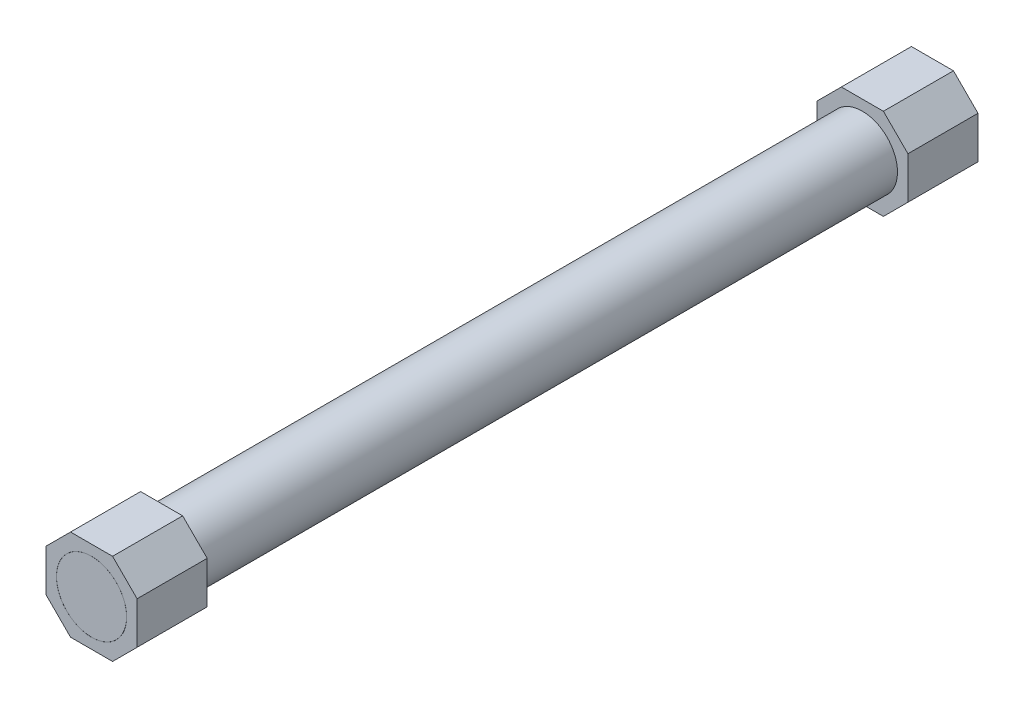
ISO-10303-21;
HEADER;
FILE_DESCRIPTION(('STEP AP214'),'2;1');
FILE_NAME('part.step','',(''),(''),'','','');
FILE_SCHEMA(('AUTOMOTIVE_DESIGN { 1 0 10303 214 1 1 1 1 }'));
ENDSEC;
DATA;
#1=APPLICATION_CONTEXT('core data for automotive mechanical design processes');
#2=APPLICATION_PROTOCOL_DEFINITION('international standard','automotive_design',2000,#1);
#3=PRODUCT_CONTEXT('',#1,'mechanical');
#4=PRODUCT('Part','Part','',(#3));
#5=PRODUCT_RELATED_PRODUCT_CATEGORY('part','',(#4));
#6=PRODUCT_DEFINITION_FORMATION('','',#4);
#7=PRODUCT_DEFINITION_CONTEXT('part definition',#1,'design');
#8=PRODUCT_DEFINITION('design','',#6,#7);
#9=PRODUCT_DEFINITION_SHAPE('','',#8);
#10=(LENGTH_UNIT() NAMED_UNIT(*) SI_UNIT(.MILLI.,.METRE.));
#11=(NAMED_UNIT(*) PLANE_ANGLE_UNIT() SI_UNIT($,.RADIAN.));
#12=(NAMED_UNIT(*) SI_UNIT($,.STERADIAN.) SOLID_ANGLE_UNIT());
#13=UNCERTAINTY_MEASURE_WITH_UNIT(LENGTH_MEASURE(1.E-05),#10,'distance_accuracy_value','');
#14=(GEOMETRIC_REPRESENTATION_CONTEXT(3) GLOBAL_UNCERTAINTY_ASSIGNED_CONTEXT((#13)) GLOBAL_UNIT_ASSIGNED_CONTEXT((#10,
#11,#12)) REPRESENTATION_CONTEXT('',''));
#15=CARTESIAN_POINT('',(0.,0.,0.));
#16=DIRECTION('',(0.,0.,1.));
#17=DIRECTION('',(1.,0.,0.));
#18=AXIS2_PLACEMENT_3D('',#15,#16,#17);
#19=CARTESIAN_POINT('',(-3.,6.5,9.99999999999999));
#20=DIRECTION('',(-0.707106781186548,0.707106781186547,0.));
#21=DIRECTION('',(-0.707106781186547,-0.707106781186548,0.));
#22=AXIS2_PLACEMENT_3D('',#19,#20,#21);
#23=PLANE('',#22);
#24=DIRECTION('',(-0.707106781186547,-0.707106781186548,0.));
#25=VECTOR('',#24,1.);
#26=CARTESIAN_POINT('',(-3.,6.5,0.));
#27=LINE('',#26,#25);
#28=CARTESIAN_POINT('',(-3.,6.5,0.));
#29=VERTEX_POINT('',#28);
#30=CARTESIAN_POINT('',(-6.5,3.,0.));
#31=VERTEX_POINT('',#30);
#32=EDGE_CURVE('E148',#29,#31,#27,.T.);
#33=ORIENTED_EDGE('',*,*,#32,.T.);
#34=DIRECTION('',(0.,0.,-1.));
#35=VECTOR('',#34,1.);
#36=CARTESIAN_POINT('',(-6.5,3.,9.99999999999999));
#37=LINE('',#36,#35);
#38=CARTESIAN_POINT('',(-6.5,3.,9.99999999999999));
#39=VERTEX_POINT('',#38);
#40=EDGE_CURVE('E55',#39,#31,#37,.T.);
#41=ORIENTED_EDGE('',*,*,#40,.F.);
#42=DIRECTION('',(-0.707106781186547,-0.707106781186548,0.));
#43=VECTOR('',#42,1.);
#44=CARTESIAN_POINT('',(-3.,6.5,9.99999999999999));
#45=LINE('',#44,#43);
#46=CARTESIAN_POINT('',(-3.,6.5,9.99999999999999));
#47=VERTEX_POINT('',#46);
#48=EDGE_CURVE('E162',#47,#39,#45,.T.);
#49=ORIENTED_EDGE('',*,*,#48,.F.);
#50=DIRECTION('',(0.,0.,-1.));
#51=VECTOR('',#50,1.);
#52=CARTESIAN_POINT('',(-3.,6.5,9.99999999999999));
#53=LINE('',#52,#51);
#54=EDGE_CURVE('E12',#47,#29,#53,.T.);
#55=ORIENTED_EDGE('',*,*,#54,.T.);
#56=EDGE_LOOP('',(#33,#41,#49,#55));
#57=FACE_BOUND('',#56,.T.);
#58=ADVANCED_FACE('F52',(#57),#23,.T.);
#59=CARTESIAN_POINT('',(3.,6.5,9.99999999999999));
#60=DIRECTION('',(0.,1.,0.));
#61=DIRECTION('',(-1.,0.,0.));
#62=AXIS2_PLACEMENT_3D('',#59,#60,#61);
#63=PLANE('',#62);
#64=DIRECTION('',(-1.,0.,0.));
#65=VECTOR('',#64,1.);
#66=CARTESIAN_POINT('',(3.,6.5,0.));
#67=LINE('',#66,#65);
#68=CARTESIAN_POINT('',(3.,6.5,0.));
#69=VERTEX_POINT('',#68);
#70=EDGE_CURVE('E105',#69,#29,#67,.T.);
#71=ORIENTED_EDGE('',*,*,#70,.T.);
#72=ORIENTED_EDGE('',*,*,#54,.F.);
#73=DIRECTION('',(-1.,0.,0.));
#74=VECTOR('',#73,1.);
#75=CARTESIAN_POINT('',(3.,6.5,9.99999999999999));
#76=LINE('',#75,#74);
#77=CARTESIAN_POINT('',(3.,6.5,9.99999999999999));
#78=VERTEX_POINT('',#77);
#79=EDGE_CURVE('E70',#78,#47,#76,.T.);
#80=ORIENTED_EDGE('',*,*,#79,.F.);
#81=DIRECTION('',(0.,0.,-1.));
#82=VECTOR('',#81,1.);
#83=CARTESIAN_POINT('',(3.,6.5,9.99999999999999));
#84=LINE('',#83,#82);
#85=EDGE_CURVE('E61',#78,#69,#84,.T.);
#86=ORIENTED_EDGE('',*,*,#85,.T.);
#87=EDGE_LOOP('',(#71,#72,#80,#86));
#88=FACE_BOUND('',#87,.T.);
#89=ADVANCED_FACE('F217',(#88),#63,.T.);
#90=CARTESIAN_POINT('',(3.,6.5,9.99999999999999));
#91=DIRECTION('',(0.707106781186547,0.707106781186548,0.));
#92=DIRECTION('',(-0.707106781186548,0.707106781186547,0.));
#93=AXIS2_PLACEMENT_3D('',#90,#91,#92);
#94=PLANE('',#93);
#95=DIRECTION('',(-0.707106781186548,0.707106781186547,0.));
#96=VECTOR('',#95,1.);
#97=CARTESIAN_POINT('',(3.,6.5,0.));
#98=LINE('',#97,#96);
#99=CARTESIAN_POINT('',(6.5,3.,0.));
#100=VERTEX_POINT('',#99);
#101=EDGE_CURVE('E99',#100,#69,#98,.T.);
#102=ORIENTED_EDGE('',*,*,#101,.T.);
#103=ORIENTED_EDGE('',*,*,#85,.F.);
#104=DIRECTION('',(-0.707106781186548,0.707106781186547,0.));
#105=VECTOR('',#104,1.);
#106=CARTESIAN_POINT('',(3.,6.5,9.99999999999999));
#107=LINE('',#106,#105);
#108=CARTESIAN_POINT('',(6.5,3.,9.99999999999999));
#109=VERTEX_POINT('',#108);
#110=EDGE_CURVE('E130',#109,#78,#107,.T.);
#111=ORIENTED_EDGE('',*,*,#110,.F.);
#112=DIRECTION('',(0.,0.,-1.));
#113=VECTOR('',#112,1.);
#114=CARTESIAN_POINT('',(6.5,3.,9.99999999999999));
#115=LINE('',#114,#113);
#116=EDGE_CURVE('E137',#109,#100,#115,.T.);
#117=ORIENTED_EDGE('',*,*,#116,.T.);
#118=EDGE_LOOP('',(#102,#103,#111,#117));
#119=FACE_BOUND('',#118,.T.);
#120=ADVANCED_FACE('F143',(#119),#94,.T.);
#121=CARTESIAN_POINT('',(6.5,3.,9.99999999999999));
#122=DIRECTION('',(1.,0.,0.));
#123=DIRECTION('',(0.,1.,0.));
#124=AXIS2_PLACEMENT_3D('',#121,#122,#123);
#125=PLANE('',#124);
#126=DIRECTION('',(0.,1.,0.));
#127=VECTOR('',#126,1.);
#128=CARTESIAN_POINT('',(6.5,3.,0.));
#129=LINE('',#128,#127);
#130=CARTESIAN_POINT('',(6.5,-2.99999999999999,0.));
#131=VERTEX_POINT('',#130);
#132=EDGE_CURVE('E140',#131,#100,#129,.T.);
#133=ORIENTED_EDGE('',*,*,#132,.T.);
#134=ORIENTED_EDGE('',*,*,#116,.F.);
#135=DIRECTION('',(0.,1.,0.));
#136=VECTOR('',#135,1.);
#137=CARTESIAN_POINT('',(6.5,3.,9.99999999999999));
#138=LINE('',#137,#136);
#139=CARTESIAN_POINT('',(6.5,-2.99999999999999,9.99999999999999));
#140=VERTEX_POINT('',#139);
#141=EDGE_CURVE('E126',#140,#109,#138,.T.);
#142=ORIENTED_EDGE('',*,*,#141,.F.);
#143=DIRECTION('',(0.,0.,-1.));
#144=VECTOR('',#143,1.);
#145=CARTESIAN_POINT('',(6.5,-2.99999999999999,9.99999999999999));
#146=LINE('',#145,#144);
#147=EDGE_CURVE('E141',#140,#131,#146,.T.);
#148=ORIENTED_EDGE('',*,*,#147,.T.);
#149=EDGE_LOOP('',(#133,#134,#142,#148));
#150=FACE_BOUND('',#149,.T.);
#151=ADVANCED_FACE('F138',(#150),#125,.T.);
#152=CARTESIAN_POINT('',(6.5,-2.99999999999999,9.99999999999999));
#153=DIRECTION('',(0.707106781186548,-0.707106781186547,0.));
#154=DIRECTION('',(0.707106781186547,0.707106781186548,0.));
#155=AXIS2_PLACEMENT_3D('',#152,#153,#154);
#156=PLANE('',#155);
#157=DIRECTION('',(0.707106781186547,0.707106781186548,0.));
#158=VECTOR('',#157,1.);
#159=CARTESIAN_POINT('',(6.5,-2.99999999999999,0.));
#160=LINE('',#159,#158);
#161=CARTESIAN_POINT('',(3.,-6.49999999999999,0.));
#162=VERTEX_POINT('',#161);
#163=EDGE_CURVE('E158',#162,#131,#160,.T.);
#164=ORIENTED_EDGE('',*,*,#163,.T.);
#165=ORIENTED_EDGE('',*,*,#147,.F.);
#166=DIRECTION('',(0.707106781186547,0.707106781186548,0.));
#167=VECTOR('',#166,1.);
#168=CARTESIAN_POINT('',(6.5,-2.99999999999999,9.99999999999999));
#169=LINE('',#168,#167);
#170=CARTESIAN_POINT('',(3.,-6.49999999999999,9.99999999999999));
#171=VERTEX_POINT('',#170);
#172=EDGE_CURVE('E132',#171,#140,#169,.T.);
#173=ORIENTED_EDGE('',*,*,#172,.F.);
#174=DIRECTION('',(0.,0.,-1.));
#175=VECTOR('',#174,1.);
#176=CARTESIAN_POINT('',(3.,-6.49999999999999,9.99999999999999));
#177=LINE('',#176,#175);
#178=EDGE_CURVE('E166',#171,#162,#177,.T.);
#179=ORIENTED_EDGE('',*,*,#178,.T.);
#180=EDGE_LOOP('',(#164,#165,#173,#179));
#181=FACE_BOUND('',#180,.T.);
#182=ADVANCED_FACE('F229',(#181),#156,.T.);
#183=CARTESIAN_POINT('',(-3.,-6.5,9.99999999999999));
#184=DIRECTION('',(0.,-1.,0.));
#185=DIRECTION('',(1.,0.,0.));
#186=AXIS2_PLACEMENT_3D('',#183,#184,#185);
#187=PLANE('',#186);
#188=DIRECTION('',(1.,0.,0.));
#189=VECTOR('',#188,1.);
#190=CARTESIAN_POINT('',(-3.,-6.5,0.));
#191=LINE('',#190,#189);
#192=CARTESIAN_POINT('',(-3.,-6.5,0.));
#193=VERTEX_POINT('',#192);
#194=EDGE_CURVE('E156',#193,#162,#191,.T.);
#195=ORIENTED_EDGE('',*,*,#194,.T.);
#196=ORIENTED_EDGE('',*,*,#178,.F.);
#197=DIRECTION('',(1.,0.,0.));
#198=VECTOR('',#197,1.);
#199=CARTESIAN_POINT('',(-3.,-6.5,9.99999999999999));
#200=LINE('',#199,#198);
#201=CARTESIAN_POINT('',(-3.,-6.5,9.99999999999999));
#202=VERTEX_POINT('',#201);
#203=EDGE_CURVE('E191',#202,#171,#200,.T.);
#204=ORIENTED_EDGE('',*,*,#203,.F.);
#205=DIRECTION('',(0.,0.,-1.));
#206=VECTOR('',#205,1.);
#207=CARTESIAN_POINT('',(-3.,-6.5,9.99999999999999));
#208=LINE('',#207,#206);
#209=EDGE_CURVE('E169',#202,#193,#208,.T.);
#210=ORIENTED_EDGE('',*,*,#209,.T.);
#211=EDGE_LOOP('',(#195,#196,#204,#210));
#212=FACE_BOUND('',#211,.T.);
#213=ADVANCED_FACE('F189',(#212),#187,.T.);
#214=CARTESIAN_POINT('',(-6.5,-3.,9.99999999999999));
#215=DIRECTION('',(-0.707106781186547,-0.707106781186548,0.));
#216=DIRECTION('',(0.707106781186548,-0.707106781186547,0.));
#217=AXIS2_PLACEMENT_3D('',#214,#215,#216);
#218=PLANE('',#217);
#219=DIRECTION('',(0.707106781186548,-0.707106781186547,0.));
#220=VECTOR('',#219,1.);
#221=CARTESIAN_POINT('',(-6.5,-3.,0.));
#222=LINE('',#221,#220);
#223=CARTESIAN_POINT('',(-6.5,-3.,0.));
#224=VERTEX_POINT('',#223);
#225=EDGE_CURVE('E154',#224,#193,#222,.T.);
#226=ORIENTED_EDGE('',*,*,#225,.T.);
#227=ORIENTED_EDGE('',*,*,#209,.F.);
#228=DIRECTION('',(0.707106781186548,-0.707106781186547,0.));
#229=VECTOR('',#228,1.);
#230=CARTESIAN_POINT('',(-6.5,-3.,9.99999999999999));
#231=LINE('',#230,#229);
#232=CARTESIAN_POINT('',(-6.5,-3.,9.99999999999999));
#233=VERTEX_POINT('',#232);
#234=EDGE_CURVE('E192',#233,#202,#231,.T.);
#235=ORIENTED_EDGE('',*,*,#234,.F.);
#236=DIRECTION('',(0.,0.,-1.));
#237=VECTOR('',#236,1.);
#238=CARTESIAN_POINT('',(-6.5,-3.,9.99999999999999));
#239=LINE('',#238,#237);
#240=EDGE_CURVE('E171',#233,#224,#239,.T.);
#241=ORIENTED_EDGE('',*,*,#240,.T.);
#242=EDGE_LOOP('',(#226,#227,#235,#241));
#243=FACE_BOUND('',#242,.T.);
#244=ADVANCED_FACE('F186',(#243),#218,.T.);
#245=CARTESIAN_POINT('',(-6.5,3.,9.99999999999999));
#246=DIRECTION('',(-1.,0.,0.));
#247=DIRECTION('',(0.,0.,-1.));
#248=AXIS2_PLACEMENT_3D('',#245,#246,#247);
#249=PLANE('',#248);
#250=DIRECTION('',(0.,-1.,0.));
#251=VECTOR('',#250,1.);
#252=CARTESIAN_POINT('',(-6.5,3.,0.));
#253=LINE('',#252,#251);
#254=EDGE_CURVE('E151',#31,#224,#253,.T.);
#255=ORIENTED_EDGE('',*,*,#254,.T.);
#256=ORIENTED_EDGE('',*,*,#240,.F.);
#257=DIRECTION('',(0.,-1.,0.));
#258=VECTOR('',#257,1.);
#259=CARTESIAN_POINT('',(-6.5,3.,9.99999999999999));
#260=LINE('',#259,#258);
#261=EDGE_CURVE('E113',#39,#233,#260,.T.);
#262=ORIENTED_EDGE('',*,*,#261,.F.);
#263=ORIENTED_EDGE('',*,*,#40,.T.);
#264=EDGE_LOOP('',(#255,#256,#262,#263));
#265=FACE_BOUND('',#264,.T.);
#266=ADVANCED_FACE('F177',(#265),#249,.T.);
#267=CARTESIAN_POINT('',(0.,0.,9.99999999999999));
#268=DIRECTION('',(0.,0.,-1.));
#269=DIRECTION('',(1.,0.,0.));
#270=AXIS2_PLACEMENT_3D('',#267,#268,#269);
#271=PLANE('',#270);
#272=CARTESIAN_POINT('',(0.,0.,9.99999999999999));
#273=DIRECTION('',(0.,0.,1.));
#274=DIRECTION('',(1.,0.,0.));
#275=AXIS2_PLACEMENT_3D('',#272,#273,#274);
#276=CIRCLE('',#275,5.01);
#277=CARTESIAN_POINT('',(5.01,0.,9.99999999999999));
#278=VERTEX_POINT('',#277);
#279=EDGE_CURVE('E152',#278,#278,#276,.T.);
#280=ORIENTED_EDGE('',*,*,#279,.F.);
#281=EDGE_LOOP('',(#280));
#282=FACE_BOUND('',#281,.T.);
#283=ORIENTED_EDGE('',*,*,#48,.T.);
#284=ORIENTED_EDGE('',*,*,#261,.T.);
#285=ORIENTED_EDGE('',*,*,#234,.T.);
#286=ORIENTED_EDGE('',*,*,#203,.T.);
#287=ORIENTED_EDGE('',*,*,#172,.T.);
#288=ORIENTED_EDGE('',*,*,#141,.T.);
#289=ORIENTED_EDGE('',*,*,#110,.T.);
#290=ORIENTED_EDGE('',*,*,#79,.T.);
#291=EDGE_LOOP('',(#283,#284,#285,#286,#287,#288,#289,#290));
#292=FACE_BOUND('',#291,.T.);
#293=ADVANCED_FACE('F128',(#282,#292),#271,.F.);
#294=CARTESIAN_POINT('',(0.,0.,0.));
#295=DIRECTION('',(0.,0.,-1.));
#296=DIRECTION('',(1.,0.,0.));
#297=AXIS2_PLACEMENT_3D('',#294,#295,#296);
#298=PLANE('',#297);
#299=CARTESIAN_POINT('',(0.,0.,0.));
#300=DIRECTION('',(0.,0.,1.));
#301=DIRECTION('',(1.,0.,0.));
#302=AXIS2_PLACEMENT_3D('',#299,#300,#301);
#303=CIRCLE('',#302,5.01);
#304=CARTESIAN_POINT('',(5.01,0.,0.));
#305=VERTEX_POINT('',#304);
#306=EDGE_CURVE('E198',#305,#305,#303,.T.);
#307=ORIENTED_EDGE('',*,*,#306,.T.);
#308=EDGE_LOOP('',(#307));
#309=FACE_BOUND('',#308,.T.);
#310=ORIENTED_EDGE('',*,*,#32,.F.);
#311=ORIENTED_EDGE('',*,*,#70,.F.);
#312=ORIENTED_EDGE('',*,*,#101,.F.);
#313=ORIENTED_EDGE('',*,*,#132,.F.);
#314=ORIENTED_EDGE('',*,*,#163,.F.);
#315=ORIENTED_EDGE('',*,*,#194,.F.);
#316=ORIENTED_EDGE('',*,*,#225,.F.);
#317=ORIENTED_EDGE('',*,*,#254,.F.);
#318=EDGE_LOOP('',(#310,#311,#312,#313,#314,#315,#316,#317));
#319=FACE_BOUND('',#318,.T.);
#320=ADVANCED_FACE('F182',(#309,#319),#298,.T.);
#321=CARTESIAN_POINT('',(0.,0.,9.99999999999999));
#322=DIRECTION('',(0.,0.,-1.));
#323=DIRECTION('',(1.,0.,0.));
#324=AXIS2_PLACEMENT_3D('',#321,#322,#323);
#325=CYLINDRICAL_SURFACE('',#324,5.01);
#326=ORIENTED_EDGE('',*,*,#279,.T.);
#327=EDGE_LOOP('',(#326));
#328=FACE_BOUND('',#327,.T.);
#329=ORIENTED_EDGE('',*,*,#306,.F.);
#330=EDGE_LOOP('',(#329));
#331=FACE_BOUND('',#330,.T.);
#332=ADVANCED_FACE('F204',(#328,#331),#325,.F.);
#333=CLOSED_SHELL('',(#58,#89,#120,#151,#182,#213,#244,#266,#293,#320,#332));
#334=MANIFOLD_SOLID_BREP('B2',#333);
#335=CARTESIAN_POINT('',(-3.,6.5,110.));
#336=DIRECTION('',(-0.707106781186548,0.707106781186547,0.));
#337=DIRECTION('',(-0.707106781186547,-0.707106781186548,0.));
#338=AXIS2_PLACEMENT_3D('',#335,#336,#337);
#339=PLANE('',#338);
#340=DIRECTION('',(-0.707106781186547,-0.707106781186548,0.));
#341=VECTOR('',#340,1.);
#342=CARTESIAN_POINT('',(-3.,6.5,120.));
#343=LINE('',#342,#341);
#344=CARTESIAN_POINT('',(-3.,6.5,120.));
#345=VERTEX_POINT('',#344);
#346=CARTESIAN_POINT('',(-6.5,3.,120.));
#347=VERTEX_POINT('',#346);
#348=EDGE_CURVE('E407',#345,#347,#343,.T.);
#349=ORIENTED_EDGE('',*,*,#348,.F.);
#350=DIRECTION('',(0.,0.,1.));
#351=VECTOR('',#350,1.);
#352=CARTESIAN_POINT('',(-3.,6.5,110.));
#353=LINE('',#352,#351);
#354=CARTESIAN_POINT('',(-3.,6.5,110.));
#355=VERTEX_POINT('',#354);
#356=EDGE_CURVE('E50',#355,#345,#353,.T.);
#357=ORIENTED_EDGE('',*,*,#356,.F.);
#358=DIRECTION('',(-0.707106781186547,-0.707106781186548,0.));
#359=VECTOR('',#358,1.);
#360=CARTESIAN_POINT('',(-3.,6.5,110.));
#361=LINE('',#360,#359);
#362=CARTESIAN_POINT('',(-6.5,3.,110.));
#363=VERTEX_POINT('',#362);
#364=EDGE_CURVE('E428',#355,#363,#361,.T.);
#365=ORIENTED_EDGE('',*,*,#364,.T.);
#366=DIRECTION('',(0.,0.,1.));
#367=VECTOR('',#366,1.);
#368=CARTESIAN_POINT('',(-6.5,3.,110.));
#369=LINE('',#368,#367);
#370=EDGE_CURVE('E313',#363,#347,#369,.T.);
#371=ORIENTED_EDGE('',*,*,#370,.T.);
#372=EDGE_LOOP('',(#349,#357,#365,#371));
#373=FACE_BOUND('',#372,.T.);
#374=ADVANCED_FACE('F310',(#373),#339,.T.);
#375=CARTESIAN_POINT('',(3.,6.5,110.));
#376=DIRECTION('',(0.,1.,0.));
#377=DIRECTION('',(-1.,0.,0.));
#378=AXIS2_PLACEMENT_3D('',#375,#376,#377);
#379=PLANE('',#378);
#380=DIRECTION('',(-1.,0.,0.));
#381=VECTOR('',#380,1.);
#382=CARTESIAN_POINT('',(3.,6.5,120.));
#383=LINE('',#382,#381);
#384=CARTESIAN_POINT('',(3.,6.5,120.));
#385=VERTEX_POINT('',#384);
#386=EDGE_CURVE('E426',#385,#345,#383,.T.);
#387=ORIENTED_EDGE('',*,*,#386,.F.);
#388=DIRECTION('',(0.,0.,1.));
#389=VECTOR('',#388,1.);
#390=CARTESIAN_POINT('',(3.,6.5,110.));
#391=LINE('',#390,#389);
#392=CARTESIAN_POINT('',(3.,6.5,110.));
#393=VERTEX_POINT('',#392);
#394=EDGE_CURVE('E319',#393,#385,#391,.T.);
#395=ORIENTED_EDGE('',*,*,#394,.F.);
#396=DIRECTION('',(-1.,0.,0.));
#397=VECTOR('',#396,1.);
#398=CARTESIAN_POINT('',(3.,6.5,110.));
#399=LINE('',#398,#397);
#400=EDGE_CURVE('E397',#393,#355,#399,.T.);
#401=ORIENTED_EDGE('',*,*,#400,.T.);
#402=ORIENTED_EDGE('',*,*,#356,.T.);
#403=EDGE_LOOP('',(#387,#395,#401,#402));
#404=FACE_BOUND('',#403,.T.);
#405=ADVANCED_FACE('F440',(#404),#379,.T.);
#406=CARTESIAN_POINT('',(3.,6.5,110.));
#407=DIRECTION('',(0.707106781186547,0.707106781186548,0.));
#408=DIRECTION('',(-0.707106781186548,0.707106781186547,0.));
#409=AXIS2_PLACEMENT_3D('',#406,#407,#408);
#410=PLANE('',#409);
#411=DIRECTION('',(-0.707106781186548,0.707106781186547,0.));
#412=VECTOR('',#411,1.);
#413=CARTESIAN_POINT('',(3.,6.5,120.));
#414=LINE('',#413,#412);
#415=CARTESIAN_POINT('',(6.5,3.,120.));
#416=VERTEX_POINT('',#415);
#417=EDGE_CURVE('E384',#416,#385,#414,.T.);
#418=ORIENTED_EDGE('',*,*,#417,.F.);
#419=DIRECTION('',(0.,0.,1.));
#420=VECTOR('',#419,1.);
#421=CARTESIAN_POINT('',(6.5,3.,110.));
#422=LINE('',#421,#420);
#423=CARTESIAN_POINT('',(6.5,3.,110.));
#424=VERTEX_POINT('',#423);
#425=EDGE_CURVE('E379',#424,#416,#422,.T.);
#426=ORIENTED_EDGE('',*,*,#425,.F.);
#427=DIRECTION('',(-0.707106781186548,0.707106781186547,0.));
#428=VECTOR('',#427,1.);
#429=CARTESIAN_POINT('',(3.,6.5,110.));
#430=LINE('',#429,#428);
#431=EDGE_CURVE('E382',#424,#393,#430,.T.);
#432=ORIENTED_EDGE('',*,*,#431,.T.);
#433=ORIENTED_EDGE('',*,*,#394,.T.);
#434=EDGE_LOOP('',(#418,#426,#432,#433));
#435=FACE_BOUND('',#434,.T.);
#436=ADVANCED_FACE('F381',(#435),#410,.T.);
#437=CARTESIAN_POINT('',(6.5,3.,110.));
#438=DIRECTION('',(1.,0.,0.));
#439=DIRECTION('',(0.,1.,0.));
#440=AXIS2_PLACEMENT_3D('',#437,#438,#439);
#441=PLANE('',#440);
#442=DIRECTION('',(0.,1.,0.));
#443=VECTOR('',#442,1.);
#444=CARTESIAN_POINT('',(6.5,3.,120.));
#445=LINE('',#444,#443);
#446=CARTESIAN_POINT('',(6.5,-2.99999999999999,120.));
#447=VERTEX_POINT('',#446);
#448=EDGE_CURVE('E423',#447,#416,#445,.T.);
#449=ORIENTED_EDGE('',*,*,#448,.F.);
#450=DIRECTION('',(0.,0.,1.));
#451=VECTOR('',#450,1.);
#452=CARTESIAN_POINT('',(6.5,-2.99999999999999,110.));
#453=LINE('',#452,#451);
#454=CARTESIAN_POINT('',(6.5,-2.99999999999999,110.));
#455=VERTEX_POINT('',#454);
#456=EDGE_CURVE('E389',#455,#447,#453,.T.);
#457=ORIENTED_EDGE('',*,*,#456,.F.);
#458=DIRECTION('',(0.,1.,0.));
#459=VECTOR('',#458,1.);
#460=CARTESIAN_POINT('',(6.5,3.,110.));
#461=LINE('',#460,#459);
#462=EDGE_CURVE('E395',#455,#424,#461,.T.);
#463=ORIENTED_EDGE('',*,*,#462,.T.);
#464=ORIENTED_EDGE('',*,*,#425,.T.);
#465=EDGE_LOOP('',(#449,#457,#463,#464));
#466=FACE_BOUND('',#465,.T.);
#467=ADVANCED_FACE('F399',(#466),#441,.T.);
#468=CARTESIAN_POINT('',(6.5,-2.99999999999999,110.));
#469=DIRECTION('',(0.707106781186548,-0.707106781186547,0.));
#470=DIRECTION('',(0.707106781186547,0.707106781186548,0.));
#471=AXIS2_PLACEMENT_3D('',#468,#469,#470);
#472=PLANE('',#471);
#473=DIRECTION('',(0.707106781186547,0.707106781186548,0.));
#474=VECTOR('',#473,1.);
#475=CARTESIAN_POINT('',(6.5,-2.99999999999999,120.));
#476=LINE('',#475,#474);
#477=CARTESIAN_POINT('',(3.,-6.49999999999999,120.));
#478=VERTEX_POINT('',#477);
#479=EDGE_CURVE('E420',#478,#447,#476,.T.);
#480=ORIENTED_EDGE('',*,*,#479,.F.);
#481=DIRECTION('',(0.,0.,1.));
#482=VECTOR('',#481,1.);
#483=CARTESIAN_POINT('',(3.,-6.49999999999999,110.));
#484=LINE('',#483,#482);
#485=CARTESIAN_POINT('',(3.,-6.49999999999999,110.));
#486=VERTEX_POINT('',#485);
#487=EDGE_CURVE('E432',#486,#478,#484,.T.);
#488=ORIENTED_EDGE('',*,*,#487,.F.);
#489=DIRECTION('',(0.707106781186547,0.707106781186548,0.));
#490=VECTOR('',#489,1.);
#491=CARTESIAN_POINT('',(6.5,-2.99999999999999,110.));
#492=LINE('',#491,#490);
#493=EDGE_CURVE('E400',#486,#455,#492,.T.);
#494=ORIENTED_EDGE('',*,*,#493,.T.);
#495=ORIENTED_EDGE('',*,*,#456,.T.);
#496=EDGE_LOOP('',(#480,#488,#494,#495));
#497=FACE_BOUND('',#496,.T.);
#498=ADVANCED_FACE('F453',(#497),#472,.T.);
#499=CARTESIAN_POINT('',(-3.,-6.5,110.));
#500=DIRECTION('',(0.,-1.,0.));
#501=DIRECTION('',(1.,0.,0.));
#502=AXIS2_PLACEMENT_3D('',#499,#500,#501);
#503=PLANE('',#502);
#504=DIRECTION('',(1.,0.,0.));
#505=VECTOR('',#504,1.);
#506=CARTESIAN_POINT('',(-3.,-6.5,120.));
#507=LINE('',#506,#505);
#508=CARTESIAN_POINT('',(-3.,-6.5,120.));
#509=VERTEX_POINT('',#508);
#510=EDGE_CURVE('E417',#509,#478,#507,.T.);
#511=ORIENTED_EDGE('',*,*,#510,.F.);
#512=DIRECTION('',(0.,0.,1.));
#513=VECTOR('',#512,1.);
#514=CARTESIAN_POINT('',(-3.,-6.5,110.));
#515=LINE('',#514,#513);
#516=CARTESIAN_POINT('',(-3.,-6.5,110.));
#517=VERTEX_POINT('',#516);
#518=EDGE_CURVE('E434',#517,#509,#515,.T.);
#519=ORIENTED_EDGE('',*,*,#518,.F.);
#520=DIRECTION('',(1.,0.,0.));
#521=VECTOR('',#520,1.);
#522=CARTESIAN_POINT('',(-3.,-6.5,110.));
#523=LINE('',#522,#521);
#524=EDGE_CURVE('E402',#517,#486,#523,.T.);
#525=ORIENTED_EDGE('',*,*,#524,.T.);
#526=ORIENTED_EDGE('',*,*,#487,.T.);
#527=EDGE_LOOP('',(#511,#519,#525,#526));
#528=FACE_BOUND('',#527,.T.);
#529=ADVANCED_FACE('F456',(#528),#503,.T.);
#530=CARTESIAN_POINT('',(-6.5,-3.,110.));
#531=DIRECTION('',(-0.707106781186547,-0.707106781186548,0.));
#532=DIRECTION('',(0.707106781186548,-0.707106781186547,0.));
#533=AXIS2_PLACEMENT_3D('',#530,#531,#532);
#534=PLANE('',#533);
#535=DIRECTION('',(0.707106781186548,-0.707106781186547,0.));
#536=VECTOR('',#535,1.);
#537=CARTESIAN_POINT('',(-6.5,-3.,120.));
#538=LINE('',#537,#536);
#539=CARTESIAN_POINT('',(-6.5,-3.,120.));
#540=VERTEX_POINT('',#539);
#541=EDGE_CURVE('E414',#540,#509,#538,.T.);
#542=ORIENTED_EDGE('',*,*,#541,.F.);
#543=DIRECTION('',(0.,0.,1.));
#544=VECTOR('',#543,1.);
#545=CARTESIAN_POINT('',(-6.5,-3.,110.));
#546=LINE('',#545,#544);
#547=CARTESIAN_POINT('',(-6.5,-3.,110.));
#548=VERTEX_POINT('',#547);
#549=EDGE_CURVE('E435',#548,#540,#546,.T.);
#550=ORIENTED_EDGE('',*,*,#549,.F.);
#551=DIRECTION('',(0.707106781186548,-0.707106781186547,0.));
#552=VECTOR('',#551,1.);
#553=CARTESIAN_POINT('',(-6.5,-3.,110.));
#554=LINE('',#553,#552);
#555=EDGE_CURVE('E491',#548,#517,#554,.T.);
#556=ORIENTED_EDGE('',*,*,#555,.T.);
#557=ORIENTED_EDGE('',*,*,#518,.T.);
#558=EDGE_LOOP('',(#542,#550,#556,#557));
#559=FACE_BOUND('',#558,.T.);
#560=ADVANCED_FACE('F460',(#559),#534,.T.);
#561=CARTESIAN_POINT('',(-6.5,3.,110.));
#562=DIRECTION('',(-1.,0.,0.));
#563=DIRECTION('',(0.,0.,1.));
#564=AXIS2_PLACEMENT_3D('',#561,#562,#563);
#565=PLANE('',#564);
#566=DIRECTION('',(0.,-1.,0.));
#567=VECTOR('',#566,1.);
#568=CARTESIAN_POINT('',(-6.5,3.,120.));
#569=LINE('',#568,#567);
#570=EDGE_CURVE('E410',#347,#540,#569,.T.);
#571=ORIENTED_EDGE('',*,*,#570,.F.);
#572=ORIENTED_EDGE('',*,*,#370,.F.);
#573=DIRECTION('',(0.,-1.,0.));
#574=VECTOR('',#573,1.);
#575=CARTESIAN_POINT('',(-6.5,3.,110.));
#576=LINE('',#575,#574);
#577=EDGE_CURVE('E489',#363,#548,#576,.T.);
#578=ORIENTED_EDGE('',*,*,#577,.T.);
#579=ORIENTED_EDGE('',*,*,#549,.T.);
#580=EDGE_LOOP('',(#571,#572,#578,#579));
#581=FACE_BOUND('',#580,.T.);
#582=ADVANCED_FACE('F437',(#581),#565,.T.);
#583=CARTESIAN_POINT('',(0.,0.,110.));
#584=DIRECTION('',(0.,0.,1.));
#585=DIRECTION('',(1.,0.,0.));
#586=AXIS2_PLACEMENT_3D('',#583,#584,#585);
#587=PLANE('',#586);
#588=CARTESIAN_POINT('',(0.,0.,110.));
#589=DIRECTION('',(0.,0.,1.));
#590=DIRECTION('',(1.,0.,0.));
#591=AXIS2_PLACEMENT_3D('',#588,#589,#590);
#592=CIRCLE('',#591,5.01);
#593=CARTESIAN_POINT('',(5.01,0.,110.));
#594=VERTEX_POINT('',#593);
#595=EDGE_CURVE('E411',#594,#594,#592,.T.);
#596=ORIENTED_EDGE('',*,*,#595,.T.);
#597=EDGE_LOOP('',(#596));
#598=FACE_BOUND('',#597,.T.);
#599=ORIENTED_EDGE('',*,*,#364,.F.);
#600=ORIENTED_EDGE('',*,*,#400,.F.);
#601=ORIENTED_EDGE('',*,*,#431,.F.);
#602=ORIENTED_EDGE('',*,*,#462,.F.);
#603=ORIENTED_EDGE('',*,*,#493,.F.);
#604=ORIENTED_EDGE('',*,*,#524,.F.);
#605=ORIENTED_EDGE('',*,*,#555,.F.);
#606=ORIENTED_EDGE('',*,*,#577,.F.);
#607=EDGE_LOOP('',(#599,#600,#601,#602,#603,#604,#605,#606));
#608=FACE_BOUND('',#607,.T.);
#609=ADVANCED_FACE('F393',(#598,#608),#587,.F.);
#610=CARTESIAN_POINT('',(0.,0.,120.));
#611=DIRECTION('',(0.,0.,1.));
#612=DIRECTION('',(1.,0.,0.));
#613=AXIS2_PLACEMENT_3D('',#610,#611,#612);
#614=PLANE('',#613);
#615=CARTESIAN_POINT('',(0.,0.,120.));
#616=DIRECTION('',(0.,0.,1.));
#617=DIRECTION('',(1.,0.,0.));
#618=AXIS2_PLACEMENT_3D('',#615,#616,#617);
#619=CIRCLE('',#618,5.01);
#620=CARTESIAN_POINT('',(5.01,0.,120.));
#621=VERTEX_POINT('',#620);
#622=EDGE_CURVE('E484',#621,#621,#619,.T.);
#623=ORIENTED_EDGE('',*,*,#622,.F.);
#624=EDGE_LOOP('',(#623));
#625=FACE_BOUND('',#624,.T.);
#626=ORIENTED_EDGE('',*,*,#348,.T.);
#627=ORIENTED_EDGE('',*,*,#570,.T.);
#628=ORIENTED_EDGE('',*,*,#541,.T.);
#629=ORIENTED_EDGE('',*,*,#510,.T.);
#630=ORIENTED_EDGE('',*,*,#479,.T.);
#631=ORIENTED_EDGE('',*,*,#448,.T.);
#632=ORIENTED_EDGE('',*,*,#417,.T.);
#633=ORIENTED_EDGE('',*,*,#386,.T.);
#634=EDGE_LOOP('',(#626,#627,#628,#629,#630,#631,#632,#633));
#635=FACE_BOUND('',#634,.T.);
#636=ADVANCED_FACE('F439',(#625,#635),#614,.T.);
#637=CARTESIAN_POINT('',(0.,0.,110.));
#638=DIRECTION('',(0.,0.,1.));
#639=DIRECTION('',(1.,0.,0.));
#640=AXIS2_PLACEMENT_3D('',#637,#638,#639);
#641=CYLINDRICAL_SURFACE('',#640,5.01);
#642=ORIENTED_EDGE('',*,*,#595,.F.);
#643=EDGE_LOOP('',(#642));
#644=FACE_BOUND('',#643,.T.);
#645=ORIENTED_EDGE('',*,*,#622,.T.);
#646=EDGE_LOOP('',(#645));
#647=FACE_BOUND('',#646,.T.);
#648=ADVANCED_FACE('F472',(#644,#647),#641,.F.);
#649=CLOSED_SHELL('',(#374,#405,#436,#467,#498,#529,#560,#582,#609,#636,#648));
#650=MANIFOLD_SOLID_BREP('B6',#649);
#651=CARTESIAN_POINT('',(0.,0.,120.));
#652=DIRECTION('',(0.,0.,-1.));
#653=DIRECTION('',(-1.,0.,0.));
#654=AXIS2_PLACEMENT_3D('',#651,#652,#653);
#655=CYLINDRICAL_SURFACE('',#654,5.);
#656=CARTESIAN_POINT('',(0.,0.,120.));
#657=DIRECTION('',(0.,0.,1.));
#658=DIRECTION('',(1.,0.,0.));
#659=AXIS2_PLACEMENT_3D('',#656,#657,#658);
#660=CIRCLE('',#659,5.);
#661=CARTESIAN_POINT('',(5.,0.,120.));
#662=VERTEX_POINT('',#661);
#663=EDGE_CURVE('E309',#662,#662,#660,.T.);
#664=ORIENTED_EDGE('',*,*,#663,.F.);
#665=EDGE_LOOP('',(#664));
#666=FACE_BOUND('',#665,.T.);
#667=CARTESIAN_POINT('',(0.,0.,0.));
#668=DIRECTION('',(0.,0.,1.));
#669=DIRECTION('',(1.,0.,0.));
#670=AXIS2_PLACEMENT_3D('',#667,#668,#669);
#671=CIRCLE('',#670,5.);
#672=CARTESIAN_POINT('',(5.,0.,0.));
#673=VERTEX_POINT('',#672);
#674=EDGE_CURVE('E564',#673,#673,#671,.T.);
#675=ORIENTED_EDGE('',*,*,#674,.T.);
#676=EDGE_LOOP('',(#675));
#677=FACE_BOUND('',#676,.T.);
#678=ADVANCED_FACE('F561',(#666,#677),#655,.T.);
#679=CARTESIAN_POINT('',(0.,0.,120.));
#680=DIRECTION('',(0.,0.,1.));
#681=DIRECTION('',(1.,0.,0.));
#682=AXIS2_PLACEMENT_3D('',#679,#680,#681);
#683=PLANE('',#682);
#684=ORIENTED_EDGE('',*,*,#663,.T.);
#685=EDGE_LOOP('',(#684));
#686=FACE_BOUND('',#685,.T.);
#687=ADVANCED_FACE('F576',(#686),#683,.T.);
#688=CARTESIAN_POINT('',(0.,0.,0.));
#689=DIRECTION('',(0.,0.,1.));
#690=DIRECTION('',(1.,0.,0.));
#691=AXIS2_PLACEMENT_3D('',#688,#689,#690);
#692=PLANE('',#691);
#693=ORIENTED_EDGE('',*,*,#674,.F.);
#694=EDGE_LOOP('',(#693));
#695=FACE_BOUND('',#694,.T.);
#696=ADVANCED_FACE('F574',(#695),#692,.F.);
#697=CLOSED_SHELL('',(#678,#687,#696));
#698=MANIFOLD_SOLID_BREP('B44',#697);
#699=ADVANCED_BREP_SHAPE_REPRESENTATION('',(#18,#334,#650,#698),#14);
#700=SHAPE_DEFINITION_REPRESENTATION(#9,#699);
ENDSEC;
END-ISO-10303-21;
